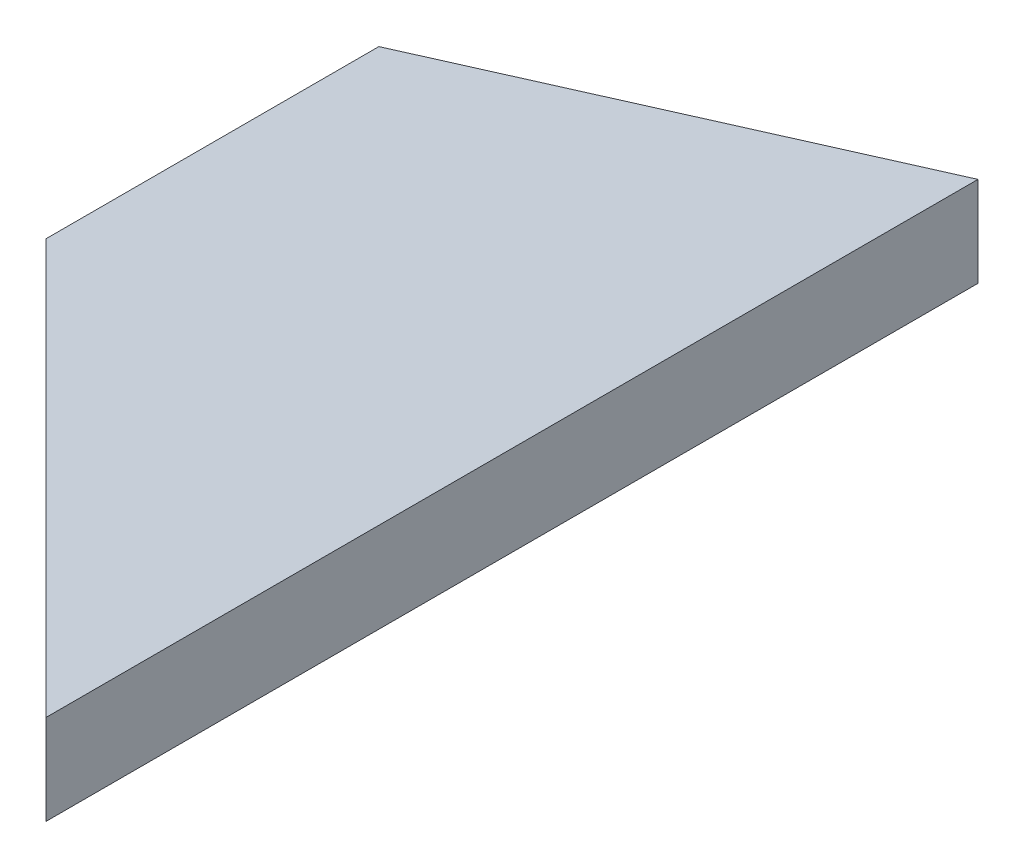
ISO-10303-21;
HEADER;
FILE_DESCRIPTION(('STEP AP214'),'2;1');
FILE_NAME('part.step','',(''),(''),'','','');
FILE_SCHEMA(('AUTOMOTIVE_DESIGN { 1 0 10303 214 1 1 1 1 }'));
ENDSEC;
DATA;
#1=APPLICATION_CONTEXT('core data for automotive mechanical design processes');
#2=APPLICATION_PROTOCOL_DEFINITION('international standard','automotive_design',2000,#1);
#3=PRODUCT_CONTEXT('',#1,'mechanical');
#4=PRODUCT('Part','Part','',(#3));
#5=PRODUCT_RELATED_PRODUCT_CATEGORY('part','',(#4));
#6=PRODUCT_DEFINITION_FORMATION('','',#4);
#7=PRODUCT_DEFINITION_CONTEXT('part definition',#1,'design');
#8=PRODUCT_DEFINITION('design','',#6,#7);
#9=PRODUCT_DEFINITION_SHAPE('','',#8);
#10=(LENGTH_UNIT() NAMED_UNIT(*) SI_UNIT(.MILLI.,.METRE.));
#11=(NAMED_UNIT(*) PLANE_ANGLE_UNIT() SI_UNIT($,.RADIAN.));
#12=(NAMED_UNIT(*) SI_UNIT($,.STERADIAN.) SOLID_ANGLE_UNIT());
#13=UNCERTAINTY_MEASURE_WITH_UNIT(LENGTH_MEASURE(1.E-05),#10,'distance_accuracy_value','');
#14=(GEOMETRIC_REPRESENTATION_CONTEXT(3) GLOBAL_UNCERTAINTY_ASSIGNED_CONTEXT((#13)) GLOBAL_UNIT_ASSIGNED_CONTEXT((#10,
#11,#12)) REPRESENTATION_CONTEXT('',''));
#15=CARTESIAN_POINT('',(0.,0.,0.));
#16=DIRECTION('',(0.,0.,1.));
#17=DIRECTION('',(1.,0.,0.));
#18=AXIS2_PLACEMENT_3D('',#15,#16,#17);
#19=CARTESIAN_POINT('',(28.575,0.,88.9));
#20=DIRECTION('',(0.,1.,0.));
#21=DIRECTION('',(-1.,0.,0.));
#22=AXIS2_PLACEMENT_3D('',#19,#20,#21);
#23=PLANE('',#22);
#24=DIRECTION('',(0.,0.,-1.));
#25=VECTOR('',#24,1.);
#26=CARTESIAN_POINT('',(0.,0.,88.9));
#27=LINE('',#26,#25);
#28=CARTESIAN_POINT('',(0.,0.,60.3249999999998));
#29=VERTEX_POINT('',#28);
#30=CARTESIAN_POINT('',(0.,0.,28.5750000000005));
#31=VERTEX_POINT('',#30);
#32=EDGE_CURVE('E89',#29,#31,#27,.T.);
#33=ORIENTED_EDGE('',*,*,#32,.T.);
#34=DIRECTION('',(0.707106781186544,0.,-0.707106781186551));
#35=VECTOR('',#34,1.);
#36=CARTESIAN_POINT('',(0.,0.,28.5750000000005));
#37=LINE('',#36,#35);
#38=CARTESIAN_POINT('',(28.575,0.,0.));
#39=VERTEX_POINT('',#38);
#40=EDGE_CURVE('E79',#31,#39,#37,.T.);
#41=ORIENTED_EDGE('',*,*,#40,.T.);
#42=DIRECTION('',(0.,0.,-1.));
#43=VECTOR('',#42,1.);
#44=CARTESIAN_POINT('',(28.575,0.,88.9));
#45=LINE('',#44,#43);
#46=CARTESIAN_POINT('',(28.575,0.,88.9));
#47=VERTEX_POINT('',#46);
#48=EDGE_CURVE('E86',#47,#39,#45,.T.);
#49=ORIENTED_EDGE('',*,*,#48,.F.);
#50=DIRECTION('',(0.707106781186551,0.,0.707106781186544));
#51=VECTOR('',#50,1.);
#52=CARTESIAN_POINT('',(28.5750000000005,0.,88.9));
#53=LINE('',#52,#51);
#54=EDGE_CURVE('E72',#47,#29,#53,.F.);
#55=ORIENTED_EDGE('',*,*,#54,.T.);
#56=EDGE_LOOP('',(#33,#41,#49,#55));
#57=FACE_BOUND('',#56,.T.);
#58=ADVANCED_FACE('F32',(#57),#23,.F.);
#59=CARTESIAN_POINT('',(28.575,8.58908519886321,88.9));
#60=DIRECTION('',(-1.,0.,0.));
#61=DIRECTION('',(0.,0.,1.));
#62=AXIS2_PLACEMENT_3D('',#59,#60,#61);
#63=PLANE('',#62);
#64=DIRECTION('',(0.,1.,0.));
#65=VECTOR('',#64,1.);
#66=CARTESIAN_POINT('',(28.575,8.58908519886321,0.));
#67=LINE('',#66,#65);
#68=CARTESIAN_POINT('',(28.575,8.58908519886321,0.));
#69=VERTEX_POINT('',#68);
#70=EDGE_CURVE('E90',#39,#69,#67,.T.);
#71=ORIENTED_EDGE('',*,*,#70,.T.);
#72=DIRECTION('',(0.,0.,-1.));
#73=VECTOR('',#72,1.);
#74=CARTESIAN_POINT('',(28.575,8.58908519886321,88.9));
#75=LINE('',#74,#73);
#76=CARTESIAN_POINT('',(28.575,8.58908519886321,88.9));
#77=VERTEX_POINT('',#76);
#78=EDGE_CURVE('E88',#77,#69,#75,.T.);
#79=ORIENTED_EDGE('',*,*,#78,.F.);
#80=DIRECTION('',(0.,1.,0.));
#81=VECTOR('',#80,1.);
#82=CARTESIAN_POINT('',(28.575,8.58908519886321,88.9));
#83=LINE('',#82,#81);
#84=EDGE_CURVE('E75',#47,#77,#83,.T.);
#85=ORIENTED_EDGE('',*,*,#84,.F.);
#86=ORIENTED_EDGE('',*,*,#48,.T.);
#87=EDGE_LOOP('',(#71,#79,#85,#86));
#88=FACE_BOUND('',#87,.T.);
#89=ADVANCED_FACE('F85',(#88),#63,.F.);
#90=CARTESIAN_POINT('',(0.,19.558,88.9));
#91=DIRECTION('',(-0.358367949545294,-0.933580426497204,0.));
#92=DIRECTION('',(0.933580426497204,-0.358367949545294,0.));
#93=AXIS2_PLACEMENT_3D('',#90,#91,#92);
#94=PLANE('',#93);
#95=ORIENTED_EDGE('',*,*,#78,.T.);
#96=DIRECTION('',(-0.682414773418205,0.261954488492086,0.682414773418212));
#97=VECTOR('',#96,1.);
#98=CARTESIAN_POINT('',(3.49621962529786,18.2159270272632,25.0787803747026));
#99=LINE('',#98,#97);
#100=CARTESIAN_POINT('',(0.,19.558,28.5750000000005));
#101=VERTEX_POINT('',#100);
#102=EDGE_CURVE('E11',#69,#101,#99,.T.);
#103=ORIENTED_EDGE('',*,*,#102,.T.);
#104=DIRECTION('',(0.,0.,-1.));
#105=VECTOR('',#104,1.);
#106=CARTESIAN_POINT('',(0.,19.558,88.9));
#107=LINE('',#106,#105);
#108=CARTESIAN_POINT('',(0.,19.558,60.3249999999998));
#109=VERTEX_POINT('',#108);
#110=EDGE_CURVE('E94',#109,#101,#107,.T.);
#111=ORIENTED_EDGE('',*,*,#110,.F.);
#112=DIRECTION('',(-0.682414773418212,0.261954488492089,-0.682414773418204));
#113=VECTOR('',#112,1.);
#114=CARTESIAN_POINT('',(30.1103987235725,7.99970084944446,90.435398723572));
#115=LINE('',#114,#113);
#116=EDGE_CURVE('E40',#109,#77,#115,.F.);
#117=ORIENTED_EDGE('',*,*,#116,.T.);
#118=EDGE_LOOP('',(#95,#103,#111,#117));
#119=FACE_BOUND('',#118,.T.);
#120=ADVANCED_FACE('F100',(#119),#94,.F.);
#121=CARTESIAN_POINT('',(0.,0.,88.9));
#122=DIRECTION('',(1.,0.,0.));
#123=DIRECTION('',(0.,0.,-1.));
#124=AXIS2_PLACEMENT_3D('',#121,#122,#123);
#125=PLANE('',#124);
#126=ORIENTED_EDGE('',*,*,#110,.T.);
#127=DIRECTION('',(0.,-1.,0.));
#128=VECTOR('',#127,1.);
#129=CARTESIAN_POINT('',(0.,0.,28.5750000000005));
#130=LINE('',#129,#128);
#131=EDGE_CURVE('E80',#101,#31,#130,.T.);
#132=ORIENTED_EDGE('',*,*,#131,.T.);
#133=ORIENTED_EDGE('',*,*,#32,.F.);
#134=DIRECTION('',(0.,1.,0.));
#135=VECTOR('',#134,1.);
#136=CARTESIAN_POINT('',(0.,0.,60.3249999999998));
#137=LINE('',#136,#135);
#138=EDGE_CURVE('E52',#29,#109,#137,.T.);
#139=ORIENTED_EDGE('',*,*,#138,.T.);
#140=EDGE_LOOP('',(#126,#132,#133,#139));
#141=FACE_BOUND('',#140,.T.);
#142=ADVANCED_FACE('F106',(#141),#125,.F.);
#143=CARTESIAN_POINT('',(0.,0.,28.5750000000005));
#144=DIRECTION('',(-0.707106781186551,0.,-0.707106781186544));
#145=DIRECTION('',(0.,1.,0.));
#146=AXIS2_PLACEMENT_3D('',#143,#144,#145);
#147=PLANE('',#146);
#148=ORIENTED_EDGE('',*,*,#102,.F.);
#149=ORIENTED_EDGE('',*,*,#70,.F.);
#150=ORIENTED_EDGE('',*,*,#40,.F.);
#151=ORIENTED_EDGE('',*,*,#131,.F.);
#152=EDGE_LOOP('',(#148,#149,#150,#151));
#153=FACE_BOUND('',#152,.T.);
#154=ADVANCED_FACE('F105',(#153),#147,.T.);
#155=CARTESIAN_POINT('',(28.5750000000005,0.,88.9));
#156=DIRECTION('',(0.707106781186544,0.,-0.707106781186551));
#157=DIRECTION('',(0.,-1.,0.));
#158=AXIS2_PLACEMENT_3D('',#155,#156,#157);
#159=PLANE('',#158);
#160=ORIENTED_EDGE('',*,*,#116,.F.);
#161=ORIENTED_EDGE('',*,*,#138,.F.);
#162=ORIENTED_EDGE('',*,*,#54,.F.);
#163=ORIENTED_EDGE('',*,*,#84,.T.);
#164=EDGE_LOOP('',(#160,#161,#162,#163));
#165=FACE_BOUND('',#164,.T.);
#166=ADVANCED_FACE('F34',(#165),#159,.F.);
#167=CLOSED_SHELL('',(#58,#89,#120,#142,#154,#166));
#168=MANIFOLD_SOLID_BREP('B2',#167);
#169=ADVANCED_BREP_SHAPE_REPRESENTATION('',(#18,#168),#14);
#170=SHAPE_DEFINITION_REPRESENTATION(#9,#169);
ENDSEC;
END-ISO-10303-21;
